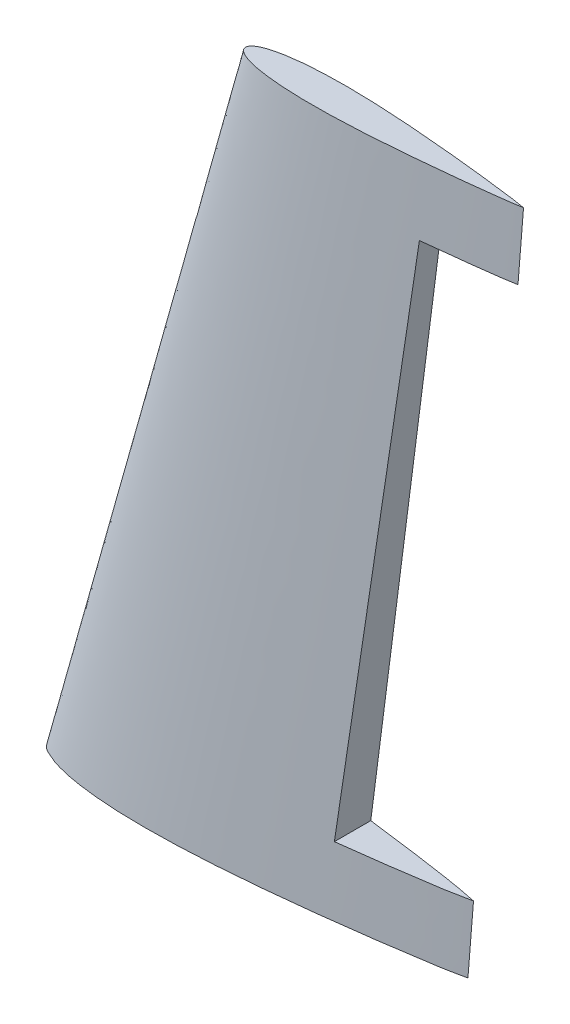
ISO-10303-21;
HEADER;
FILE_DESCRIPTION(('STEP AP214'),'2;1');
FILE_NAME('part.step','',(''),(''),'','','');
FILE_SCHEMA(('AUTOMOTIVE_DESIGN { 1 0 10303 214 1 1 1 1 }'));
ENDSEC;
DATA;
#1=APPLICATION_CONTEXT('core data for automotive mechanical design processes');
#2=APPLICATION_PROTOCOL_DEFINITION('international standard','automotive_design',2000,#1);
#3=PRODUCT_CONTEXT('',#1,'mechanical');
#4=PRODUCT('Part','Part','',(#3));
#5=PRODUCT_RELATED_PRODUCT_CATEGORY('part','',(#4));
#6=PRODUCT_DEFINITION_FORMATION('','',#4);
#7=PRODUCT_DEFINITION_CONTEXT('part definition',#1,'design');
#8=PRODUCT_DEFINITION('design','',#6,#7);
#9=PRODUCT_DEFINITION_SHAPE('','',#8);
#10=(LENGTH_UNIT() NAMED_UNIT(*) SI_UNIT(.MILLI.,.METRE.));
#11=(NAMED_UNIT(*) PLANE_ANGLE_UNIT() SI_UNIT($,.RADIAN.));
#12=(NAMED_UNIT(*) SI_UNIT($,.STERADIAN.) SOLID_ANGLE_UNIT());
#13=UNCERTAINTY_MEASURE_WITH_UNIT(LENGTH_MEASURE(1.E-05),#10,'distance_accuracy_value','');
#14=(GEOMETRIC_REPRESENTATION_CONTEXT(3) GLOBAL_UNCERTAINTY_ASSIGNED_CONTEXT((#13)) GLOBAL_UNIT_ASSIGNED_CONTEXT((#10,
#11,#12)) REPRESENTATION_CONTEXT('',''));
#15=CARTESIAN_POINT('',(0.,0.,0.));
#16=DIRECTION('',(0.,0.,1.));
#17=DIRECTION('',(1.,0.,0.));
#18=AXIS2_PLACEMENT_3D('',#15,#16,#17);
#19=CARTESIAN_POINT('',(0.,0.,0.));
#20=CARTESIAN_POINT('',(70.,250.,0.));
#21=CARTESIAN_POINT('',(0.195655478270852,0.,0.768978353918807));
#22=CARTESIAN_POINT('',(69.9986959845257,250.,0.559557329975513));
#23=CARTESIAN_POINT('',(0.660572033620584,0.,1.90007401564167));
#24=CARTESIAN_POINT('',(70.4422059324332,250.,1.26093304533634));
#25=CARTESIAN_POINT('',(1.52946508615385,0.,3.1403496450901));
#26=CARTESIAN_POINT('',(71.2121542995077,250.,1.88563978889603));
#27=CARTESIAN_POINT('',(2.08744009329708,0.,3.73764641932674));
#28=CARTESIAN_POINT('',(71.6667755137423,250.,2.17536174032659));
#29=CARTESIAN_POINT('',(3.08187299954048,0.,4.62172729711457));
#30=CARTESIAN_POINT('',(72.4329623126014,250.,2.61245656864863));
#31=CARTESIAN_POINT('',(4.19325189814782,0.,5.21603391430506));
#32=CARTESIAN_POINT('',(73.1948590143615,250.,2.94033718487233));
#33=CARTESIAN_POINT('',(5.59158015090889,0.,5.85259541205401));
#34=CARTESIAN_POINT('',(74.1415097621237,250.,3.28449303859547));
#35=CARTESIAN_POINT('',(6.68097742812297,0.,6.3337610745264));
#36=CARTESIAN_POINT('',(74.8869826600464,250.,3.53140799117662));
#37=CARTESIAN_POINT('',(8.12990500399271,0.,6.91831102915743));
#38=CARTESIAN_POINT('',(75.8834310114874,250.,3.819225587461));
#39=CARTESIAN_POINT('',(9.73930368303478,0.,7.45106762134593));
#40=CARTESIAN_POINT('',(76.9722727163433,250.,4.08980488765973));
#41=CARTESIAN_POINT('',(10.9062769503005,0.,7.78320423819411));
#42=CARTESIAN_POINT('',(77.7545849567519,250.,4.26170468307525));
#43=CARTESIAN_POINT('',(12.4576936991834,0.,8.20016367855782));
#44=CARTESIAN_POINT('',(78.7942261907797,250.,4.4758230209911));
#45=CARTESIAN_POINT('',(13.6696072170429,0.,8.49285134046993));
#46=CARTESIAN_POINT('',(79.6057609647194,250.,4.6240211178324));
#47=CARTESIAN_POINT('',(15.9014214187112,0.,8.97499562861494));
#48=CARTESIAN_POINT('',(81.096511241294,250.,4.86794863902424));
#49=CARTESIAN_POINT('',(17.8006239355461,0.,9.33262730154482));
#50=CARTESIAN_POINT('',(82.3614405724931,250.,5.04879621995214));
#51=CARTESIAN_POINT('',(19.9738741598646,0.,9.67697903054977));
#52=CARTESIAN_POINT('',(83.8063814045382,250.,5.22258488040277));
#53=CARTESIAN_POINT('',(22.238950637709,0.,9.99957996172536));
#54=CARTESIAN_POINT('',(85.3108301729104,250.,5.38564414124795));
#55=CARTESIAN_POINT('',(24.0482170869822,0.,10.2162956776922));
#56=CARTESIAN_POINT('',(86.5109885313154,250.,5.49490150487442));
#57=CARTESIAN_POINT('',(26.560353060244,0.,10.4772827523105));
#58=CARTESIAN_POINT('',(88.1762870085194,250.,5.62611207392554));
#59=CARTESIAN_POINT('',(29.1860847168737,0.,10.711773786491));
#60=CARTESIAN_POINT('',(89.9158243877766,250.,5.74368503992877));
#61=CARTESIAN_POINT('',(32.8966208658665,0.,10.956328312211));
#62=CARTESIAN_POINT('',(92.3724388839714,250.,5.86408546122133));
#63=CARTESIAN_POINT('',(37.7506876990212,0.,11.1715663050003));
#64=CARTESIAN_POINT('',(95.5841901256043,250.,5.96905050552955));
#65=CARTESIAN_POINT('',(41.4256776455018,0.,11.2397813072375));
#66=CARTESIAN_POINT('',(98.0150607926343,250.,5.99967397330177));
#67=CARTESIAN_POINT('',(47.7391016485707,0.,11.2685271452159));
#68=CARTESIAN_POINT('',(102.190912434374,250.,6.00624507222266));
#69=CARTESIAN_POINT('',(51.9472947406066,0.,11.1911552796935));
#70=CARTESIAN_POINT('',(104.974151836875,250.,5.96002880896557));
#71=CARTESIAN_POINT('',(58.545986993472,0.,10.9558171505861));
#72=CARTESIAN_POINT('',(109.339375626508,250.,5.82913889742743));
#73=CARTESIAN_POINT('',(62.6309350556134,0.,10.7636434588563));
#74=CARTESIAN_POINT('',(112.042120239292,250.,5.72418241247027));
#75=CARTESIAN_POINT('',(69.6371477236821,0.,10.3386957280969));
#76=CARTESIAN_POINT('',(116.678981021888,250.,5.49400875315719));
#77=CARTESIAN_POINT('',(75.7325892229276,0.,9.88192490979644));
#78=CARTESIAN_POINT('',(120.714304376761,250.,5.2487480096044));
#79=CARTESIAN_POINT('',(85.3875019683624,0.,9.04220406718952));
#80=CARTESIAN_POINT('',(127.108494642406,250.,4.79730346754375));
#81=CARTESIAN_POINT('',(93.2631752816847,0.,8.2339333571308));
#82=CARTESIAN_POINT('',(132.32694058254,250.,4.36495736487871));
#83=CARTESIAN_POINT('',(100.935206436467,0.,7.3569912462122));
#84=CARTESIAN_POINT('',(137.412743426146,250.,3.8962239895977));
#85=CARTESIAN_POINT('',(105.028527038898,0.,6.86961961426604));
#86=CARTESIAN_POINT('',(140.126734239389,250.,3.63533409708325));
#87=CARTESIAN_POINT('',(111.00814854933,0.,6.13128831658997));
#88=CARTESIAN_POINT('',(144.09199160909,250.,3.23889356195476));
#89=CARTESIAN_POINT('',(116.824459846816,0.,5.36694345391713));
#90=CARTESIAN_POINT('',(147.950402588865,250.,2.82967749691622));
#91=CARTESIAN_POINT('',(121.651751284019,0.,4.68691190438806));
#92=CARTESIAN_POINT('',(151.15473707171,250.,2.47089840367072));
#93=CARTESIAN_POINT('',(125.183426613864,0.,4.17923310063453));
#94=CARTESIAN_POINT('',(153.499433724026,250.,2.20333752457805));
#95=CARTESIAN_POINT('',(127.928645834009,0.,3.7745444218425));
#96=CARTESIAN_POINT('',(155.322326762007,250.,1.98988689627928));
#97=CARTESIAN_POINT('',(131.447905638187,0.,3.24877076078578));
#98=CARTESIAN_POINT('',(157.659061458258,250.,1.70919303152666));
#99=CARTESIAN_POINT('',(133.260010722783,0.,2.97619084244031));
#100=CARTESIAN_POINT('',(158.862117293063,250.,1.56187611570257));
#101=CARTESIAN_POINT('',(135.560122012606,0.,2.63126488818203));
#102=CARTESIAN_POINT('',(160.388585022168,250.,1.37122079182081));
#103=CARTESIAN_POINT('',(137.460372810935,0.,2.34549252058881));
#104=CARTESIAN_POINT('',(161.649404654787,250.,1.21094186091351));
#105=CARTESIAN_POINT('',(139.569414816383,0.,2.01420764055358));
#106=CARTESIAN_POINT('',(163.049958556808,250.,1.03133532697253));
#107=CARTESIAN_POINT('',(141.642227189136,0.,1.66900661728628));
#108=CARTESIAN_POINT('',(164.428661951161,250.,0.854999673307673));
#109=CARTESIAN_POINT('',(145.017744861793,0.,1.05825280822502));
#110=CARTESIAN_POINT('',(166.678308373102,250.,0.561150371082092));
#111=CARTESIAN_POINT('',(147.972088500631,0.,0.428792180378057));
#112=CARTESIAN_POINT('',(168.652734649163,250.,0.259454475548223));
#113=CARTESIAN_POINT('',(150.,0.,0.));
#114=CARTESIAN_POINT('',(170.,250.,0.));
#115=B_SPLINE_SURFACE_WITH_KNOTS('',3,1,((#19,#20),(#21,#22),(#23,#24),(#25,#26),(#27,#28),(#29,
#30),(#31,#32),(#33,#34),(#35,#36),(#37,#38),(#39,#40),(#41,#42),(#43,#44),(#45,#46),(#47,#48),
(#49,#50),(#51,#52),(#53,#54),(#55,#56),(#57,#58),(#59,#60),(#61,#62),(#63,#64),(#65,#66),(#67,
#68),(#69,#70),(#71,#72),(#73,#74),(#75,#76),(#77,#78),(#79,#80),(#81,#82),(#83,#84),(#85,#86),
(#87,#88),(#89,#90),(#91,#92),(#93,#94),(#95,#96),(#97,#98),(#99,#100),(#101,#102),(#103,#104),
(#105,#106),(#107,#108),(#109,#110),(#111,#112),(#113,#114)),.UNSPECIFIED.,.F.,.F.,.F.,(4,1,1,1,
1,1,1,1,1,1,1,1,1,1,1,1,1,1,1,1,1,1,1,1,1,1,1,1,1,1,1,1,1,1,1,1,1,1,1,1,1,1,1,1,1,4),(2,2),(0.,
0.0156194720662421,0.0232753433303846,0.0291075419286404,0.0314587429481263,0.0492202555491914,
0.0533777786080139,0.061074796097928,0.072332266250758,0.0838833871498787,0.0940592622044786,
0.0958977986291186,0.11511405027081,0.118322991217731,0.140338064377994,0.152703718571922,
0.16113752489231,0.184858630441784,0.188156909079162,0.210283618990624,0.236152465437243,
0.26051404840834,0.304825518045286,0.307670319858064,0.383371055636416,0.38671265586774,
0.436156501706642,0.462946641558057,0.523300177064844,0.555096393590515,0.651536044513161,
0.67735316070774,0.70535980619585,0.731752349684996,0.794596405394819,0.819513726604711,
0.826616135313176,0.864027539878722,0.873511499820556,0.895859043763776,0.899686854178034,
0.918771100295154,0.933252916444237,0.941229566110318,0.959662243740333,1.),(0.,1.),.UNSPECIFIED.);
#116=DIRECTION('',(0.07974522228289,0.996815278536125,0.));
#117=VECTOR('',#116,1.);
#118=CARTESIAN_POINT('',(160.,125.,0.));
#119=LINE('',#118,#117);
#120=CARTESIAN_POINT('',(150.,0.,0.));
#121=VERTEX_POINT('',#120);
#122=CARTESIAN_POINT('',(152.,25.,0.));
#123=VERTEX_POINT('',#122);
#124=EDGE_CURVE('E132',#121,#123,#119,.T.);
#125=CARTESIAN_POINT('',(152.,25.,0.));
#126=CARTESIAN_POINT('',(151.401466096659,25.,0.12577945562425));
#127=CARTESIAN_POINT('',(150.802875475921,25.,0.251344221995793));
#128=CARTESIAN_POINT('',(149.605094931907,25.,0.499857752519421));
#129=CARTESIAN_POINT('',(149.005904957979,25.,0.622806271793478));
#130=CARTESIAN_POINT('',(148.106561817352,25.,0.80357428195709));
#131=CARTESIAN_POINT('',(147.806773955936,25.,0.863204548641396));
#132=CARTESIAN_POINT('',(147.206908653375,25.,0.980990936937096));
#133=CARTESIAN_POINT('',(146.906831212456,25.,1.03914705969305));
#134=CARTESIAN_POINT('',(146.306349868556,25.,1.15368035969721));
#135=CARTESIAN_POINT('',(146.005945980211,25.,1.21005761354412));
#136=CARTESIAN_POINT('',(145.404783041826,25.,1.32088638432623));
#137=CARTESIAN_POINT('',(145.104023991628,25.,1.37533790039718));
#138=CARTESIAN_POINT('',(144.502269483059,25.,1.48235569392));
#139=CARTESIAN_POINT('',(144.201274130468,25.,1.53492256618896));
#140=CARTESIAN_POINT('',(143.598959261173,25.,1.63816291237761));
#141=CARTESIAN_POINT('',(143.297639744661,25.,1.68883638742533));
#142=CARTESIAN_POINT('',(142.393242639191,25.,1.8382912195825));
#143=CARTESIAN_POINT('',(141.789740963887,25.,1.9345044234058));
#144=CARTESIAN_POINT('',(140.884003215696,25.,2.07568711975079));
#145=CARTESIAN_POINT('',(140.582007757344,25.,2.1222254650044));
#146=CARTESIAN_POINT('',(139.977903803053,25.,2.21456384304779));
#147=CARTESIAN_POINT('',(139.675795307184,25.,2.26036387629823));
#148=CARTESIAN_POINT('',(139.071502297875,25.,2.35144027638195));
#149=CARTESIAN_POINT('',(138.769317785105,25.,2.39671664768351));
#150=CARTESIAN_POINT('',(138.164898302783,25.,2.48693137314008));
#151=CARTESIAN_POINT('',(137.862663333226,25.,2.53186972725631));
#152=CARTESIAN_POINT('',(137.258186089737,25.,2.621603566149));
#153=CARTESIAN_POINT('',(136.955943816743,25.,2.6663990572471));
#154=CARTESIAN_POINT('',(136.351465271619,25.,2.75603031708626));
#155=CARTESIAN_POINT('',(136.049228999489,25.,2.80086608582323));
#156=CARTESIAN_POINT('',(135.142516699823,25.,2.93535448408979));
#157=CARTESIAN_POINT('',(134.538037847072,25.,3.02498810801186));
#158=CARTESIAN_POINT('',(133.329061694945,25.,3.20382412682929));
#159=CARTESIAN_POINT('',(132.724564400193,25.,3.29302655294343));
#160=CARTESIAN_POINT('',(131.515475910239,25.,3.47079153634192));
#161=CARTESIAN_POINT('',(130.910884715072,25.,3.55935409385954));
#162=CARTESIAN_POINT('',(129.701676398702,25.,3.73565715964735));
#163=CARTESIAN_POINT('',(129.097059295476,25.,3.82339779108049));
#164=CARTESIAN_POINT('',(127.88768249238,25.,3.99789080830132));
#165=CARTESIAN_POINT('',(127.282922792484,25.,4.08464319391855));
#166=CARTESIAN_POINT('',(125.46831407215,25.,4.34314084050919));
#167=CARTESIAN_POINT('',(124.258211495495,25.,4.51311545248135));
#168=CARTESIAN_POINT('',(122.442405039625,25.,4.76368316354632));
#169=CARTESIAN_POINT('',(121.837004345829,25.,4.8464764410217));
#170=CARTESIAN_POINT('',(120.625995099168,25.,5.01052894731695));
#171=CARTESIAN_POINT('',(120.020386546279,25.,5.09178817596005));
#172=CARTESIAN_POINT('',(118.203148989881,25.,5.33337632241521));
#173=CARTESIAN_POINT('',(116.991226153294,25.,5.49149942125487));
#174=CARTESIAN_POINT('',(114.566531867729,25.,5.80226410612558));
#175=CARTESIAN_POINT('',(113.353760334567,25.,5.95490503404879));
#176=CARTESIAN_POINT('',(110.927419406694,25.,6.25509953813406));
#177=CARTESIAN_POINT('',(109.713849925658,25.,6.40265241688473));
#178=CARTESIAN_POINT('',(108.5,25.,6.54784754542871));
#179=B_SPLINE_CURVE_WITH_KNOTS('',3,(#125,#126,#127,#128,#129,#130,#131,#132,#133,#134,#135,
#136,#137,#138,#139,#140,#141,#142,#143,#144,#145,#146,#147,#148,#149,#150,#151,#152,#153,#154,
#155,#156,#157,#158,#159,#160,#161,#162,#163,#164,#165,#166,#167,#168,#169,#170,#171,#172,#173,
#174,#175,#176,#177,#178),.UNSPECIFIED.,.F.,.F.,(4,2,2,2,2,2,2,2,2,2,2,2,2,2,2,2,2,2,2,2,2,2,2,
2,2,2,4),(0.,1.83484077461232,3.66985253965584,4.58683163883149,5.50381002602246,
6.42074887377736,7.33768813304953,8.25433540054875,9.17098212193016,11.0043196447908,
11.9210005569045,12.8376808970409,13.7543534095693,14.6710260272402,15.5876575033591,
16.5042888863669,18.3375536481823,20.170683631509,22.0038129465787,23.8366630320923,
25.6695134337581,29.3354448628915,31.1685504580636,33.0016562644594,36.6682254184897,
40.3352332649767,44.0027417608705),.UNSPECIFIED.);
#180=CARTESIAN_POINT('',(108.5,25.,6.54784754542871));
#181=VERTEX_POINT('',#180);
#182=EDGE_CURVE('E205',#123,#181,#179,.T.);
#183=CARTESIAN_POINT('',(108.5,25.,6.54784754542871));
#184=CARTESIAN_POINT('',(110.833333573895,41.6666683849627,6.33305481620149));
#185=CARTESIAN_POINT('',(113.166667106372,58.3333364740852,6.11823867808425));
#186=CARTESIAN_POINT('',(117.833334062421,91.6666718744377,5.68854490436401));
#187=CARTESIAN_POINT('',(120.166667485993,108.333339185668,5.473667268761));
#188=CARTESIAN_POINT('',(124.833334198452,141.666672846085,5.04383582033692));
#189=CARTESIAN_POINT('',(127.166667487338,158.333339195271,4.82888200751584));
#190=CARTESIAN_POINT('',(131.833333887544,191.666670625313,4.39887410889263));
#191=CARTESIAN_POINT('',(134.166666998863,208.333335706167,4.18382002309049));
#192=CARTESIAN_POINT('',(136.5,225.,3.96870375291261));
#193=B_SPLINE_CURVE_WITH_KNOTS('',3,(#183,#184,#185,#186,#187,#188,#189,#190,#191,#192),
.UNSPECIFIED.,.F.,.F.,(4,2,2,2,4),(0.,50.4917394119644,100.983478822807,151.475218237651,
201.966957653616),.UNSPECIFIED.);
#194=CARTESIAN_POINT('',(136.5,225.,3.96870375291261));
#195=VERTEX_POINT('',#194);
#196=EDGE_CURVE('E125',#181,#195,#193,.T.);
#197=CARTESIAN_POINT('',(136.5,225.,3.96870375291261));
#198=CARTESIAN_POINT('',(137.377695952224,225.,3.87986091876744));
#199=CARTESIAN_POINT('',(138.25523715755,225.,3.78948923577797));
#200=CARTESIAN_POINT('',(140.009920399032,225.,3.60569240039433));
#201=CARTESIAN_POINT('',(140.887062463867,225.,3.51226752179798));
#202=CARTESIAN_POINT('',(142.64094696346,225.,3.32235997294791));
#203=CARTESIAN_POINT('',(143.517689423863,225.,3.2258775395702));
#204=CARTESIAN_POINT('',(145.270769473028,225.,3.02980759405548));
#205=CARTESIAN_POINT('',(146.147107084388,225.,2.93022028401529));
#206=CARTESIAN_POINT('',(147.899378385918,225.,2.72795216478344));
#207=CARTESIAN_POINT('',(148.775312094906,225.,2.62527151855961));
#208=CARTESIAN_POINT('',(150.526792722341,225.,2.41696984914526));
#209=CARTESIAN_POINT('',(151.402339655389,225.,2.31134894869247));
#210=CARTESIAN_POINT('',(152.715451037879,225.,2.15087248748527));
#211=CARTESIAN_POINT('',(153.153140451367,225.,2.09703691756777));
#212=CARTESIAN_POINT('',(154.028438322902,225.,1.98871177744516));
#213=CARTESIAN_POINT('',(154.466046780965,225.,1.93422220736869));
#214=CARTESIAN_POINT('',(155.341179054448,225.,1.82450763081202));
#215=CARTESIAN_POINT('',(155.778702868307,225.,1.76928261186724));
#216=CARTESIAN_POINT('',(156.653650935464,225.,1.65804958365526));
#217=CARTESIAN_POINT('',(157.091075188784,225.,1.60204157456365));
#218=CARTESIAN_POINT('',(157.965819355844,225.,1.4891289622505));
#219=CARTESIAN_POINT('',(158.403139266612,225.,1.43222433601277));
#220=CARTESIAN_POINT('',(159.277690176855,225.,1.31774003824));
#221=CARTESIAN_POINT('',(159.714921176416,225.,1.26016036735882));
#222=CARTESIAN_POINT('',(160.370719955416,225.,1.17337304319059));
#223=CARTESIAN_POINT('',(160.589315343359,225.,1.1443737979291));
#224=CARTESIAN_POINT('',(161.026491522415,225.,1.08626503706974));
#225=CARTESIAN_POINT('',(161.245072313524,225.,1.05715552144238));
#226=CARTESIAN_POINT('',(161.6821940353,225.,0.998619146831524));
#227=CARTESIAN_POINT('',(161.900734965504,225.,0.969192284361424));
#228=CARTESIAN_POINT('',(162.33774186504,225.,0.909788135510916));
#229=CARTESIAN_POINT('',(162.55620783439,225.,0.879810849266727));
#230=CARTESIAN_POINT('',(163.211496702824,225.,0.788737010199306));
#231=CARTESIAN_POINT('',(163.648163630418,225.,0.726504668538582));
#232=CARTESIAN_POINT('',(164.520802558458,225.,0.597421793175145));
#233=CARTESIAN_POINT('',(164.95677458324,225.,0.530571425012477));
#234=CARTESIAN_POINT('',(165.828047841313,225.,0.390847624298362));
#235=CARTESIAN_POINT('',(166.263348467967,225.,0.317970370383577));
#236=CARTESIAN_POINT('',(167.132707712607,225.,0.164850529812257));
#237=CARTESIAN_POINT('',(167.566766158683,225.,0.0846069701410448));
#238=CARTESIAN_POINT('',(168.,225.,0.));
#239=B_SPLINE_CURVE_WITH_KNOTS('',3,(#197,#198,#199,#200,#201,#202,#203,#204,#205,#206,#207,
#208,#209,#210,#211,#212,#213,#214,#215,#216,#217,#218,#219,#220,#221,#222,#223,#224,#225,#226,
#227,#228,#229,#230,#231,#232,#233,#234,#235,#236,#237,#238),.UNSPECIFIED.,.F.,.F.,(4,2,2,2,2,2,
2,2,2,2,2,2,2,2,2,2,2,2,2,2,4),(0.,2.64654152484641,5.29284636665004,7.93894669173812,
10.5848751399155,13.23066443422,15.8763434480449,17.199306648192,18.5222695881268,
19.8452549785784,21.1682400723323,22.4912591826522,23.8142770115598,24.4758086159216,
25.1373403973476,25.7988794542859,26.460418347507,27.7836381474391,29.1068105391733,
30.430828420595,31.7550214437632),.UNSPECIFIED.);
#240=CARTESIAN_POINT('',(168.,225.,0.));
#241=VERTEX_POINT('',#240);
#242=EDGE_CURVE('E117',#195,#241,#239,.T.);
#243=CARTESIAN_POINT('',(170.,250.,0.));
#244=VERTEX_POINT('',#243);
#245=EDGE_CURVE('E91',#241,#244,#119,.T.);
#246=CARTESIAN_POINT('',(70.,250.,0.));
#247=CARTESIAN_POINT('',(69.9986959845257,250.,0.559557329975513));
#248=CARTESIAN_POINT('',(70.4422059324332,250.,1.26093304533634));
#249=CARTESIAN_POINT('',(71.2121542995077,250.,1.88563978889603));
#250=CARTESIAN_POINT('',(72.1765692085123,250.,2.5002441247187));
#251=CARTESIAN_POINT('',(73.3608592933965,250.,3.01855792734228));
#252=CARTESIAN_POINT('',(75.1227205315784,250.,3.61875069370607));
#253=CARTESIAN_POINT('',(76.6590687383961,250.,4.02363435400375));
#254=CARTESIAN_POINT('',(78.4538796406858,250.,4.41367077242441));
#255=CARTESIAN_POINT('',(80.7556730736961,250.,4.83401185582356));
#256=CARTESIAN_POINT('',(83.8644573815094,250.,5.25286849011772));
#257=CARTESIAN_POINT('',(87.9614350359515,250.,5.63382877374754));
#258=CARTESIAN_POINT('',(93.1247858390843,250.,5.92406082995801));
#259=CARTESIAN_POINT('',(99.7600745373847,250.,6.04543960753283));
#260=CARTESIAN_POINT('',(107.468637421375,250.,5.92114767489454));
#261=CARTESIAN_POINT('',(115.967916908944,250.,5.556531892471));
#262=CARTESIAN_POINT('',(125.06405736576,250.,4.96668425616192));
#263=CARTESIAN_POINT('',(134.169678192368,250.,4.21228731080838));
#264=CARTESIAN_POINT('',(143.35607633263,250.,3.32749838658548));
#265=CARTESIAN_POINT('',(150.536726311052,250.,2.55025407184005));
#266=CARTESIAN_POINT('',(156.205971927044,250.,1.8864169659321));
#267=CARTESIAN_POINT('',(159.803934973752,250.,1.44813753014802));
#268=CARTESIAN_POINT('',(164.387726212406,250.,0.858989173143308));
#269=CARTESIAN_POINT('',(167.770673401732,250.,0.429320595990857));
#270=CARTESIAN_POINT('',(170.,250.,0.));
#271=B_SPLINE_CURVE_WITH_KNOTS('',3,(#246,#247,#248,#249,#250,#251,#252,#253,#254,#255,#256,
#257,#258,#259,#260,#261,#262,#263,#264,#265,#266,#267,#268,#269,#270),.UNSPECIFIED.,.F.,.F.,(4,
1,1,1,1,1,1,1,1,1,1,1,1,1,1,1,1,1,1,1,1,1,4),(0.,0.01553395472415,0.0231479097340726,
0.0289481767714817,0.0489507723417046,0.060740408724977,0.08342412167123,0.0953727536841635,
0.114483795446904,0.151867658551169,0.187126741177681,0.234859519613783,0.303156584038135,
0.381272081127289,0.460411986984034,0.552057214802432,0.647968854113404,0.727745971252401,
0.822090373205299,0.859296948576311,0.894761026457467,0.928143312958565,0.994524953101524),.UNSPECIFIED.);
#272=CARTESIAN_POINT('',(70.,250.,0.));
#273=VERTEX_POINT('',#272);
#274=EDGE_CURVE('E135',#273,#244,#271,.T.);
#275=DIRECTION('',(-0.269629925519971,-0.962964019714182,0.));
#276=VECTOR('',#275,1.);
#277=CARTESIAN_POINT('',(35.,125.,0.));
#278=LINE('',#277,#276);
#279=CARTESIAN_POINT('',(0.,0.,0.));
#280=VERTEX_POINT('',#279);
#281=EDGE_CURVE('E133',#273,#280,#278,.T.);
#282=CARTESIAN_POINT('',(0.,0.,0.));
#283=CARTESIAN_POINT('',(0.394064240533343,0.,1.54877785023788));
#284=CARTESIAN_POINT('',(1.86343204533623,0.,4.10832932730232));
#285=CARTESIAN_POINT('',(5.28724909036249,0.,5.73617099980628));
#286=CARTESIAN_POINT('',(8.233222924377,0.,6.99931868497217));
#287=CARTESIAN_POINT('',(11.4396082336292,0.,7.96107398576362));
#288=CARTESIAN_POINT('',(14.8376369190267,0.,8.77467837603829));
#289=CARTESIAN_POINT('',(18.2267385280419,0.,9.41286733557134));
#290=CARTESIAN_POINT('',(21.6078998652314,0.,9.92399207912031));
#291=CARTESIAN_POINT('',(25.1773993496458,0.,10.3515502404508));
#292=CARTESIAN_POINT('',(30.2638636077661,0.,10.8139908288503));
#293=CARTESIAN_POINT('',(36.5674158128002,0.,11.1547863026209));
#294=CARTESIAN_POINT('',(45.6336442745833,0.,11.3133994355685));
#295=CARTESIAN_POINT('',(54.6599512158032,0.,11.1386331448724));
#296=CARTESIAN_POINT('',(65.7291347742381,0.,10.617890693194));
#297=CARTESIAN_POINT('',(80.6283538857991,0.,9.55346562254067));
#298=CARTESIAN_POINT('',(94.3915178799787,0.,8.13611618668952));
#299=CARTESIAN_POINT('',(108.235367187247,0.,6.48779686733447));
#300=CARTESIAN_POINT('',(115.481434177457,0.,5.5561385416536));
#301=CARTESIAN_POINT('',(124.038094924345,0.,4.35074223563081));
#302=CARTESIAN_POINT('',(129.185840061393,0.,3.58903449905146));
#303=CARTESIAN_POINT('',(134.229817913528,0.,2.83031080098395));
#304=CARTESIAN_POINT('',(137.67143784106,0.,2.31536058736914));
#305=CARTESIAN_POINT('',(140.909856218911,0.,1.8015191392422));
#306=CARTESIAN_POINT('',(145.017744861793,0.,1.05825280822502));
#307=CARTESIAN_POINT('',(147.972088500631,0.,0.428792180378057));
#308=CARTESIAN_POINT('',(150.,0.,0.));
#309=B_SPLINE_CURVE_WITH_KNOTS('',3,(#282,#283,#284,#285,#286,#287,#288,#289,#290,#291,#292,
#293,#294,#295,#296,#297,#298,#299,#300,#301,#302,#303,#304,#305,#306,#307,#308),.UNSPECIFIED.,
.F.,.F.,(4,1,1,1,1,1,1,1,1,1,1,1,1,1,1,1,1,1,1,1,1,1,1,1,4),(0.,0.0314587429481263,
0.0533777786080139,0.072332266250758,0.0940592622044786,0.118322991217731,0.140338064377994,
0.16113752489231,0.184858630441784,0.210283618990624,0.26051404840834,0.307670319858064,
0.38671265586774,0.436156501706642,0.523300177064844,0.67735316070774,0.70535980619585,
0.794596405394819,0.819513726604711,0.873511499820556,0.895859043763776,0.918771100295154,
0.941229566110318,0.959662243740333,1.),.UNSPECIFIED.);
#310=EDGE_CURVE('E158',#280,#121,#309,.T.);
#311=ORIENTED_EDGE('',*,*,#124,.T.);
#312=ORIENTED_EDGE('',*,*,#182,.T.);
#313=ORIENTED_EDGE('',*,*,#196,.T.);
#314=ORIENTED_EDGE('',*,*,#242,.T.);
#315=ORIENTED_EDGE('',*,*,#245,.T.);
#316=ORIENTED_EDGE('',*,*,#274,.F.);
#317=ORIENTED_EDGE('',*,*,#281,.T.);
#318=ORIENTED_EDGE('',*,*,#310,.T.);
#319=EDGE_LOOP('',(#311,#312,#313,#314,#315,#316,#317,#318));
#320=FACE_BOUND('',#319,.T.);
#321=ADVANCED_FACE('F62',(#320),#115,.T.);
#322=CARTESIAN_POINT('',(150.,0.,0.));
#323=CARTESIAN_POINT('',(170.,250.,0.));
#324=CARTESIAN_POINT('',(147.203728736896,0.,-0.596703086503725));
#325=CARTESIAN_POINT('',(168.141300436859,250.,-0.357945760326691));
#326=CARTESIAN_POINT('',(143.844542392479,0.,-1.29910346176235));
#327=CARTESIAN_POINT('',(165.893928859177,250.,-0.667686172563832));
#328=CARTESIAN_POINT('',(139.646817536484,0.,-2.00299402022177));
#329=CARTESIAN_POINT('',(163.101269806163,250.,-1.02473432634902));
#330=CARTESIAN_POINT('',(137.378976492,0.,-2.35719623647766));
#331=CARTESIAN_POINT('',(161.595535250208,250.,-1.21786562108361));
#332=CARTESIAN_POINT('',(134.845344194033,0.,-2.74059609804921));
#333=CARTESIAN_POINT('',(159.914206394984,250.,-1.43134010667307));
#334=CARTESIAN_POINT('',(132.144215255794,0.,-3.14366262231544));
#335=CARTESIAN_POINT('',(158.121488937878,250.,-1.65308168598492));
#336=CARTESIAN_POINT('',(129.692886778842,0.,-3.51072899413155));
#337=CARTESIAN_POINT('',(156.493874863831,250.,-1.84963275853149));
#338=CARTESIAN_POINT('',(126.975661850402,0.,-3.91474951276233));
#339=CARTESIAN_POINT('',(154.689566267685,250.,-2.06380021990477));
#340=CARTESIAN_POINT('',(125.07344856666,0.,-4.19344634310769));
#341=CARTESIAN_POINT('',(153.42651749819,250.,-2.21090594959557));
#342=CARTESIAN_POINT('',(122.712139851787,0.,-4.53500965246532));
#343=CARTESIAN_POINT('',(151.858755186052,250.,-2.39090188609898));
#344=CARTESIAN_POINT('',(117.717426361797,0.,-5.24761504038376));
#345=CARTESIAN_POINT('',(148.542876612811,250.,-2.76607135121046));
#346=CARTESIAN_POINT('',(111.547253695246,0.,-6.06439532936574));
#347=CARTESIAN_POINT('',(144.449529585196,250.,-3.20311463056925));
#348=CARTESIAN_POINT('',(105.153517956725,0.,-6.85419964317565));
#349=CARTESIAN_POINT('',(140.209632819831,250.,-3.6270544819082));
#350=CARTESIAN_POINT('',(101.060310055639,0.,-7.34237511336335));
#351=CARTESIAN_POINT('',(137.495687662368,250.,-3.88841172885298));
#352=CARTESIAN_POINT('',(93.381164448233,0.,-8.22198456519109));
#353=CARTESIAN_POINT('',(132.405126127822,250.,-4.3584797245741));
#354=CARTESIAN_POINT('',(85.0065386548647,0.,-9.08178671234308));
#355=CARTESIAN_POINT('',(126.85608475217,250.,-4.81821552327612));
#356=CARTESIAN_POINT('',(76.3070571671548,0.,-9.83010912491948));
#357=CARTESIAN_POINT('',(121.094765690402,250.,-5.22088183216181));
#358=CARTESIAN_POINT('',(71.585227812655,0.,-10.1899128029993));
#359=CARTESIAN_POINT('',(117.968612266297,250.,-5.41427937671108));
#360=CARTESIAN_POINT('',(65.9694622987038,0.,-10.5725641939584));
#361=CARTESIAN_POINT('',(114.251408918626,250.,-5.62039650989662));
#362=CARTESIAN_POINT('',(60.9280804854935,0.,-10.8538526717753));
#363=CARTESIAN_POINT('',(110.915322788481,250.,-5.7732862139699));
#364=CARTESIAN_POINT('',(53.7139334312018,0.,-11.1420011573478));
#365=CARTESIAN_POINT('',(106.142765257583,250.,-5.93223574263261));
#366=CARTESIAN_POINT('',(48.4991525439816,0.,-11.2542541706935));
#367=CARTESIAN_POINT('',(102.693471715921,250.,-5.99814186735058));
#368=CARTESIAN_POINT('',(43.6660105940415,0.,-11.2541507292901));
#369=CARTESIAN_POINT('',(99.4968186685067,250.,-6.00416130647089));
#370=CARTESIAN_POINT('',(39.2310539432817,0.,-11.2098036827104));
#371=CARTESIAN_POINT('',(96.5633912178537,250.,-5.98696294868556));
#372=CARTESIAN_POINT('',(35.3443798402432,0.,-11.0842212734471));
#373=CARTESIAN_POINT('',(93.9923251259385,250.,-5.92699236879487));
#374=CARTESIAN_POINT('',(30.3051715556657,0.,-10.7932455742697));
#375=CARTESIAN_POINT('',(90.6568565076703,250.,-5.78400416344846));
#376=CARTESIAN_POINT('',(27.8454526230814,0.,-10.6028294457268));
#377=CARTESIAN_POINT('',(89.0280847897593,250.,-5.68909228005015));
#378=CARTESIAN_POINT('',(24.3678121330773,0.,-10.2537975653091));
#379=CARTESIAN_POINT('',(86.7230713523971,250.,-5.51382281057447));
#380=CARTESIAN_POINT('',(22.4077933297717,0.,-10.023361412358));
#381=CARTESIAN_POINT('',(85.4229768196155,250.,-5.39778849146758));
#382=CARTESIAN_POINT('',(19.5864170571401,0.,-9.62220410848912));
#383=CARTESIAN_POINT('',(83.5494559065639,250.,-5.19474926704572));
#384=CARTESIAN_POINT('',(17.250980841904,0.,-9.23855965249417));
#385=CARTESIAN_POINT('',(81.9962606792744,250.,-5.00116026420013));
#386=CARTESIAN_POINT('',(15.0423680420077,0.,-8.79513114326615));
#387=CARTESIAN_POINT('',(80.5226715002189,250.,-4.7779103509668));
#388=CARTESIAN_POINT('',(13.1955600239592,0.,-8.37962918025219));
#389=CARTESIAN_POINT('',(79.2891829538309,250.,-4.56620935151217));
#390=CARTESIAN_POINT('',(11.7226232514126,0.,-8.0189709132298));
#391=CARTESIAN_POINT('',(78.3051996396538,250.,-4.37971813530801));
#392=CARTESIAN_POINT('',(10.4887427738483,0.,-7.66731889966114));
#393=CARTESIAN_POINT('',(77.4753931528398,250.,-4.20103256931581));
#394=CARTESIAN_POINT('',(8.78449404351382,0.,-7.13409791776671));
#395=CARTESIAN_POINT('',(76.3218767849775,250.,-3.93477200384775));
#396=CARTESIAN_POINT('',(7.31586995213694,0.,-6.58997838004316));
#397=CARTESIAN_POINT('',(75.3154768180722,250.,-3.66954898961228));
#398=CARTESIAN_POINT('',(5.66535098363631,0.,-5.89162381906071));
#399=CARTESIAN_POINT('',(74.1961523502563,250.,-3.30310749325793));
#400=CARTESIAN_POINT('',(4.24922045566011,0.,-5.2641360661624));
#401=CARTESIAN_POINT('',(73.2421896388264,250.,-2.96113701082741));
#402=CARTESIAN_POINT('',(3.07177828200063,0.,-4.61366371132348));
#403=CARTESIAN_POINT('',(72.4270900342667,250.,-2.60988652018706));
#404=CARTESIAN_POINT('',(2.0757277646262,0.,-3.7303367121853));
#405=CARTESIAN_POINT('',(71.6613959313592,250.,-2.17193342889503));
#406=CARTESIAN_POINT('',(1.51976881197806,0.,-3.14448287345632));
#407=CARTESIAN_POINT('',(71.2121542995192,250.,-1.88563978890509));
#408=CARTESIAN_POINT('',(0.641088596380313,0.,-1.9143929377355));
#409=CARTESIAN_POINT('',(70.4422059324422,250.,-1.26093304535086));
#410=CARTESIAN_POINT('',(0.178531775094028,0.,-0.783109986582253));
#411=CARTESIAN_POINT('',(69.998695984537,250.,-0.559557329985034));
#412=CARTESIAN_POINT('',(0.,0.,0.));
#413=CARTESIAN_POINT('',(70.,250.,0.));
#414=B_SPLINE_SURFACE_WITH_KNOTS('',3,1,((#322,#323),(#324,#325),(#326,#327),(#328,#329),(#330,
#331),(#332,#333),(#334,#335),(#336,#337),(#338,#339),(#340,#341),(#342,#343),(#344,#345),(#346,
#347),(#348,#349),(#350,#351),(#352,#353),(#354,#355),(#356,#357),(#358,#359),(#360,#361),(#362,
#363),(#364,#365),(#366,#367),(#368,#369),(#370,#371),(#372,#373),(#374,#375),(#376,#377),(#378,
#379),(#380,#381),(#382,#383),(#384,#385),(#386,#387),(#388,#389),(#390,#391),(#392,#393),(#394,
#395),(#396,#397),(#398,#399),(#400,#401),(#402,#403),(#404,#405),(#406,#407),(#408,#409),(#410,
#411),(#412,#413)),.UNSPECIFIED.,.F.,.F.,.F.,(4,1,1,1,1,1,1,1,1,1,1,1,1,1,1,1,1,1,1,1,1,1,1,1,1,
1,1,1,1,1,1,1,1,1,1,1,1,1,1,1,1,1,1,4),(2,2),(0.,0.0556503363584711,0.0667470835557493,
0.0828268685228939,0.100313145821953,0.116611583931299,0.135972460121266,0.14854669159315,
0.170068705708347,0.173383864686812,0.194974932765051,0.268247650314993,0.29449720894224,
0.320338735181534,0.34846395548683,0.444903606409477,0.484151178595618,0.51837851314884,
0.537053358441937,0.59368294189974,0.616628944363578,0.677543847825017,0.69517448195471,
0.710677272087267,0.763847534562754,0.770830850668482,0.808897905053961,0.811843090920835,
0.838842075755816,0.847296281428076,0.867285395316784,0.884885949729188,0.891142238510914,
0.90410220137088,0.914346813798334,0.91611661285012,0.938925203902071,0.94492339637412,
0.950779744450808,0.968728684871204,0.970892458071359,0.976724656669615,0.984380527933758,1.),
(0.,1.),.UNSPECIFIED.);
#415=CARTESIAN_POINT('',(136.5,225.,-3.96870149239353));
#416=CARTESIAN_POINT('',(134.166666999392,208.333335709941,-4.18381622260481));
#417=CARTESIAN_POINT('',(131.833333888498,191.666670632131,-4.39886871038074));
#418=CARTESIAN_POINT('',(127.166667488978,158.333339206983,-4.82887331755868));
#419=CARTESIAN_POINT('',(124.83333420035,141.666672859645,-5.04382543696069));
#420=CARTESIAN_POINT('',(120.166667487852,108.333339198943,-5.47365342391937));
#421=CARTESIAN_POINT('',(117.833334063981,91.6666718855803,-5.68852929147604));
#422=CARTESIAN_POINT('',(113.166667107227,58.333336480192,-6.11821946774092));
#423=CARTESIAN_POINT('',(110.833333574343,41.6666683881667,-6.33303377644914));
#424=CARTESIAN_POINT('',(108.5,25.,-6.5478246522379));
#425=B_SPLINE_CURVE_WITH_KNOTS('',3,(#415,#416,#417,#418,#419,#420,#421,#422,#423,#424),
.UNSPECIFIED.,.F.,.F.,(4,2,2,2,4),(0.,50.4917393454856,100.983478689848,151.475218039432,
201.966957390141),.UNSPECIFIED.);
#426=CARTESIAN_POINT('',(136.5,225.,-3.96870149239353));
#427=VERTEX_POINT('',#426);
#428=CARTESIAN_POINT('',(108.5,25.,-6.5478246522379));
#429=VERTEX_POINT('',#428);
#430=EDGE_CURVE('E76',#427,#429,#425,.T.);
#431=CARTESIAN_POINT('',(108.5,25.,-6.5478246522379));
#432=CARTESIAN_POINT('',(109.713846170093,25.,-6.40260743753134));
#433=CARTESIAN_POINT('',(110.927409537191,25.,-6.25501168153393));
#434=CARTESIAN_POINT('',(113.353738333819,25.,-5.95473139218497));
#435=CARTESIAN_POINT('',(114.566503849564,25.,-5.8020475551898));
#436=CARTESIAN_POINT('',(116.991190865885,25.,-5.49123856025285));
#437=CARTESIAN_POINT('',(118.20311244991,25.,-5.33311405382542));
#438=CARTESIAN_POINT('',(120.626067188232,25.,-5.01108420583345));
#439=CARTESIAN_POINT('',(121.837100418246,25.,-4.84717943489631));
#440=CARTESIAN_POINT('',(123.652962429466,25.,-4.59668062780731));
#441=CARTESIAN_POINT('',(124.25811254707,25.,-4.51241064986052));
#442=CARTESIAN_POINT('',(125.468221073377,25.,-4.3425043907147));
#443=CARTESIAN_POINT('',(126.073179481989,25.,-4.25686810887801));
#444=CARTESIAN_POINT('',(127.887739268609,25.,-3.99829874964018));
#445=CARTESIAN_POINT('',(129.097102720357,25.,-3.82369440438149));
#446=CARTESIAN_POINT('',(130.910837591359,25.,-3.55903162111814));
#447=CARTESIAN_POINT('',(131.51540991889,25.,-3.4703444977418));
#448=CARTESIAN_POINT('',(132.422214431026,25.,-3.33694570155271));
#449=CARTESIAN_POINT('',(132.724473694807,25.,-3.29241807104763));
#450=CARTESIAN_POINT('',(133.328981384586,25.,-3.20328911542749));
#451=CARTESIAN_POINT('',(133.631229810582,25.,-3.15868779030435));
#452=CARTESIAN_POINT('',(134.235747423371,25.,-3.06945661441968));
#453=CARTESIAN_POINT('',(134.538016609867,25.,-3.02482676164345));
#454=CARTESIAN_POINT('',(135.142559429658,25.,-2.93559718844338));
#455=CARTESIAN_POINT('',(135.444833062953,25.,-2.89099746802081));
#456=CARTESIAN_POINT('',(136.351639504543,25.,-2.75710089250406));
#457=CARTESIAN_POINT('',(136.95615800989,25.,-2.66770660029109));
#458=CARTESIAN_POINT('',(137.862827913984,25.,-2.53282490213881));
#459=CARTESIAN_POINT('',(138.165037922242,25.,-2.48773192118104));
#460=CARTESIAN_POINT('',(138.769403964806,25.,-2.39718545669954));
#461=CARTESIAN_POINT('',(139.071559999109,25.,-2.35173197316276));
#462=CARTESIAN_POINT('',(139.675809952049,25.,-2.26039497162176));
#463=CARTESIAN_POINT('',(139.977903870089,25.,-2.21451144967229));
#464=CARTESIAN_POINT('',(140.581994559897,25.,-2.12210626726382));
#465=CARTESIAN_POINT('',(140.883991331593,25.,-2.07558460632629));
#466=CARTESIAN_POINT('',(141.487825478419,25.,-1.98152165773097));
#467=CARTESIAN_POINT('',(141.789662854058,25.,-1.93398037335217));
#468=CARTESIAN_POINT('',(142.393119876736,25.,-1.83753557327632));
#469=CARTESIAN_POINT('',(142.694739524143,25.,-1.78863205989279));
#470=CARTESIAN_POINT('',(143.297683954799,25.,-1.6890814544905));
#471=CARTESIAN_POINT('',(143.599008745398,25.,-1.63843440713032));
#472=CARTESIAN_POINT('',(144.201296186967,25.,-1.53503017665025));
#473=CARTESIAN_POINT('',(144.502258837982,25.,-1.48227299379392));
#474=CARTESIAN_POINT('',(145.103934693278,25.,-1.37482473775889));
#475=CARTESIAN_POINT('',(145.404647791003,25.,-1.32013306881724));
#476=CARTESIAN_POINT('',(146.005752031964,25.,-1.20900798619757));
#477=CARTESIAN_POINT('',(146.306143174654,25.,-1.15257456956862));
#478=CARTESIAN_POINT('',(147.206895088569,25.,-0.9809274933751));
#479=CARTESIAN_POINT('',(147.806810025615,25.,-0.86337138029904));
#480=CARTESIAN_POINT('',(149.006020192845,25.,-0.623373343802267));
#481=CARTESIAN_POINT('',(149.605314855166,25.,-0.500928602309048));
#482=CARTESIAN_POINT('',(150.803145405656,25.,-0.252651749590869));
#483=CARTESIAN_POINT('',(151.401681359177,25.,-0.126819954283791));
#484=CARTESIAN_POINT('',(152.,25.,0.));
#485=B_SPLINE_CURVE_WITH_KNOTS('',3,(#431,#432,#433,#434,#435,#436,#437,#438,#439,#440,#441,
#442,#443,#444,#445,#446,#447,#448,#449,#450,#451,#452,#453,#454,#455,#456,#457,#458,#459,#460,
#461,#462,#463,#464,#465,#466,#467,#468,#469,#470,#471,#472,#473,#474,#475,#476,#477,#478,#479,
#480,#481,#482,#483,#484),.UNSPECIFIED.,.F.,.F.,(4,2,2,2,2,2,2,2,2,2,2,2,2,2,2,2,2,2,2,2,2,2,2,
2,2,2,4),(0.,3.66750557632791,7.33451126159333,11.0010793447544,14.6672864722198,
16.5002531730684,18.3332207293818,21.9989210773095,23.8320488114064,24.7486132218793,
25.6651777326799,26.5818163458101,27.4984549975688,29.3317318300252,30.2483986580768,
31.1650655193258,32.0817407984744,32.9984167650637,33.9150897841703,34.8317612465447,
35.7484092468879,36.6650571327405,37.5819898192171,38.498924059276,40.3328666654837,
42.167882168321,44.0027271043257),.UNSPECIFIED.);
#486=EDGE_CURVE('E12',#429,#123,#485,.T.);
#487=CARTESIAN_POINT('',(150.,0.,0.));
#488=CARTESIAN_POINT('',(147.203728736896,0.,-0.596703086503725));
#489=CARTESIAN_POINT('',(143.035293640245,0.,-1.46831605343412));
#490=CARTESIAN_POINT('',(137.115401046843,0.,-2.40243393962158));
#491=CARTESIAN_POINT('',(132.393799107002,0.,-3.10579390227472));
#492=CARTESIAN_POINT('',(127.960081342295,0.,-3.77052036955017));
#493=CARTESIAN_POINT('',(123.975633154875,0.,-4.35428933489201));
#494=CARTESIAN_POINT('',(116.550975744895,0.,-5.4162549517458));
#495=CARTESIAN_POINT('',(108.892414503593,0.,-6.4082810326731));
#496=CARTESIAN_POINT('',(94.1365803660746,0.,-8.16813209378897));
#497=CARTESIAN_POINT('',(82.6898639846534,0.,-9.34373886521911));
#498=CARTESIAN_POINT('',(68.6834812142489,0.,-10.4110260666472));
#499=CARTESIAN_POINT('',(58.7619361296964,0.,-11.001555411823));
#500=CARTESIAN_POINT('',(48.8818303425095,0.,-11.2764401347569));
#501=CARTESIAN_POINT('',(39.7779034491411,0.,-11.2375352017546));
#502=CARTESIAN_POINT('',(33.030088426838,0.,-11.0041916764183));
#503=CARTESIAN_POINT('',(26.4617846504946,0.,-10.4957144843227));
#504=CARTESIAN_POINT('',(21.537080112757,0.,-9.92676272449189));
#505=CARTESIAN_POINT('',(17.3590132787523,0.,-9.27443773742276));
#506=CARTESIAN_POINT('',(13.5600781188001,0.,-8.48845003241827));
#507=CARTESIAN_POINT('',(9.68531715427135,0.,-7.49842878238383));
#508=CARTESIAN_POINT('',(5.9748165303809,0.,-6.08124969740165));
#509=CARTESIAN_POINT('',(1.91797017599937,0.,-4.16022976430708));
#510=CARTESIAN_POINT('',(0.357433553182296,0.,-1.56784295058521));
#511=CARTESIAN_POINT('',(0.,0.,0.));
#512=B_SPLINE_CURVE_WITH_KNOTS('',3,(#487,#488,#489,#490,#491,#492,#493,#494,#495,#496,#497,
#498,#499,#500,#501,#502,#503,#504,#505,#506,#507,#508,#509,#510,#511),.UNSPECIFIED.,.F.,.F.,(4,
1,1,1,1,1,1,1,1,1,1,1,1,1,1,1,1,1,1,1,1,1,4),(0.,0.0556503363584711,0.0828268685228939,
0.116611583931299,0.14854669159315,0.170068705708347,0.194974932765051,0.29449720894224,
0.320338735181534,0.484151178595618,0.51837851314884,0.59368294189974,0.677543847825017,
0.710677272087267,0.770830850668482,0.808897905053961,0.838842075755816,0.867285395316784,
0.891142238510914,0.914346813798334,0.94492339637412,0.968728684871204,1.),.UNSPECIFIED.);
#513=EDGE_CURVE('E137',#121,#280,#512,.T.);
#514=CARTESIAN_POINT('',(170.,250.,0.));
#515=CARTESIAN_POINT('',(167.77067340174,250.,-0.42932059599879));
#516=CARTESIAN_POINT('',(164.387726212419,250.,-0.85898917314591));
#517=CARTESIAN_POINT('',(159.803934973767,250.,-1.44813753014533));
#518=CARTESIAN_POINT('',(156.205971927056,250.,-1.88641696593152));
#519=CARTESIAN_POINT('',(150.536726311066,250.,-2.55025407184604));
#520=CARTESIAN_POINT('',(143.356076332646,250.,-3.32749838658415));
#521=CARTESIAN_POINT('',(134.169678192382,250.,-4.21228731081565));
#522=CARTESIAN_POINT('',(125.064057365781,250.,-4.96668425616258));
#523=CARTESIAN_POINT('',(115.967916908959,250.,-5.55653189248028));
#524=CARTESIAN_POINT('',(107.468637421388,250.,-5.92114767489833));
#525=CARTESIAN_POINT('',(99.7600745373999,250.,-6.0454396075407));
#526=CARTESIAN_POINT('',(93.1247858390997,250.,-5.92406082996727));
#527=CARTESIAN_POINT('',(87.9614350359655,250.,-5.63382877375273));
#528=CARTESIAN_POINT('',(83.8644573815221,250.,-5.25286849012777));
#529=CARTESIAN_POINT('',(80.7556730737098,250.,-4.83401185582921));
#530=CARTESIAN_POINT('',(78.4538796407019,250.,-4.41367077243281));
#531=CARTESIAN_POINT('',(76.6590687384077,250.,-4.02363435401226));
#532=CARTESIAN_POINT('',(75.122720531592,250.,-3.61875069371176));
#533=CARTESIAN_POINT('',(73.3608592934054,250.,-3.01855792735202));
#534=CARTESIAN_POINT('',(72.1765692085273,250.,-2.50024412472688));
#535=CARTESIAN_POINT('',(71.2121542995192,250.,-1.88563978890509));
#536=CARTESIAN_POINT('',(70.4422059324422,250.,-1.26093304535086));
#537=CARTESIAN_POINT('',(69.998695984537,250.,-0.559557329985034));
#538=CARTESIAN_POINT('',(70.,250.,0.));
#539=B_SPLINE_CURVE_WITH_KNOTS('',3,(#514,#515,#516,#517,#518,#519,#520,#521,#522,#523,#524,
#525,#526,#527,#528,#529,#530,#531,#532,#533,#534,#535,#536,#537,#538),.UNSPECIFIED.,.F.,.F.,(4,
1,1,1,1,1,1,1,1,1,1,1,1,1,1,1,1,1,1,1,1,1,4),(0.,0.0663816401429441,0.0997639266440424,
0.135228004525199,0.17243457989621,0.266778981849109,0.346556098988106,0.442467738299077,
0.534112966117475,0.613252871974221,0.691368369063374,0.759665433487726,0.807398211923828,
0.84265729455034,0.880041157654605,0.899152199417346,0.911100831430279,0.933784544376532,
0.945574180759805,0.965576776330028,0.971377043367437,0.978990998377359,0.994524953101509),.UNSPECIFIED.);
#540=EDGE_CURVE('E120',#244,#273,#539,.T.);
#541=CARTESIAN_POINT('',(168.,225.,0.));
#542=CARTESIAN_POINT('',(167.566786861427,225.,-0.0847214530361249));
#543=CARTESIAN_POINT('',(167.13273343187,225.,-0.164995512505054));
#544=CARTESIAN_POINT('',(166.263369113443,225.,-0.31809019296596));
#545=CARTESIAN_POINT('',(165.828058398891,225.,-0.390911800593373));
#546=CARTESIAN_POINT('',(164.95676646637,225.,-0.530519932391155));
#547=CARTESIAN_POINT('',(164.520785855771,225.,-0.597310288914296));
#548=CARTESIAN_POINT('',(163.648145600809,225.,-0.726380825205351));
#549=CARTESIAN_POINT('',(163.21148593264,225.,-0.788660843030465));
#550=CARTESIAN_POINT('',(162.556206760185,225.,-0.879802183887993));
#551=CARTESIAN_POINT('',(162.337743772238,225.,-0.909801307734154));
#552=CARTESIAN_POINT('',(161.900739297193,225.,-0.969223328215015));
#553=CARTESIAN_POINT('',(161.682197810065,225.,-0.998646224626368));
#554=CARTESIAN_POINT('',(161.245074832755,225.,-1.05717334085331));
#555=CARTESIAN_POINT('',(161.026493343044,225.,-1.08627756419664));
#556=CARTESIAN_POINT('',(160.589315659865,225.,-1.14437487406357));
#557=CARTESIAN_POINT('',(160.370719466403,225.,-1.1733679606214));
#558=CARTESIAN_POINT('',(159.714919616447,225.,-1.26014554819856));
#559=CARTESIAN_POINT('',(159.2776895285,225.,-1.31773040218203));
#560=CARTESIAN_POINT('',(158.403146819887,225.,-1.43227406454494));
#561=CARTESIAN_POINT('',(157.965834199151,225.,-1.48923287239392));
#562=CARTESIAN_POINT('',(157.091093799911,225.,-1.60217492237642));
#563=CARTESIAN_POINT('',(156.653666024486,225.,-1.65815818834802));
#564=CARTESIAN_POINT('',(155.778707842423,225.,-1.7693170741692));
#565=CARTESIAN_POINT('',(155.341177435743,225.,-1.82449269369551));
#566=CARTESIAN_POINT('',(154.466038780074,225.,-1.93415914018171));
#567=CARTESIAN_POINT('',(154.028430532618,225.,-1.98864997937465));
#568=CARTESIAN_POINT('',(153.15313452426,225.,-2.09698934595997));
#569=CARTESIAN_POINT('',(152.715446763349,225.,-2.15083787327635));
#570=CARTESIAN_POINT('',(151.402338216302,225.,-2.31133716958777));
#571=CARTESIAN_POINT('',(150.526790503791,225.,-2.41695189609913));
#572=CARTESIAN_POINT('',(148.775310699462,225.,-2.62526122631779));
#573=CARTESIAN_POINT('',(147.899378593149,225.,-2.72795570818122));
#574=CARTESIAN_POINT('',(146.147106939443,225.,-2.9302202364755));
#575=CARTESIAN_POINT('',(145.270767373063,225.,-3.02979011848203));
#576=CARTESIAN_POINT('',(143.517685705194,225.,-3.22584518376441));
#577=CARTESIAN_POINT('',(142.640943581251,225.,-3.32233016621236));
#578=CARTESIAN_POINT('',(140.887059948574,225.,-3.51224468889463));
#579=CARTESIAN_POINT('',(140.009918414217,225.,-3.60567399250599));
#580=CARTESIAN_POINT('',(138.255236225211,225.,-3.78947952421081));
#581=CARTESIAN_POINT('',(137.377695541887,225.,-3.87985547856805));
#582=CARTESIAN_POINT('',(136.5,225.,-3.96870149239353));
#583=B_SPLINE_CURVE_WITH_KNOTS('',3,(#541,#542,#543,#544,#545,#546,#547,#548,#549,#550,#551,
#552,#553,#554,#555,#556,#557,#558,#559,#560,#561,#562,#563,#564,#565,#566,#567,#568,#569,#570,
#571,#572,#573,#574,#575,#576,#577,#578,#579,#580,#581,#582),.UNSPECIFIED.,.F.,.F.,(4,2,2,2,2,2,
2,2,2,2,2,2,2,2,2,2,2,2,2,2,4),(0.,1.32419444075307,2.64821334304481,3.97138493405122,
5.29460400973648,5.95614285311578,6.6176819529046,7.27921372197311,7.94074528725825,
9.26376252829987,10.586780890271,11.9097668778653,13.2327533950008,14.5557162443454,
15.8786792502496,18.5243583572155,21.1701476906338,23.816076019471,26.4621762497757,
29.1084809036162,31.7550221754849),.UNSPECIFIED.);
#584=EDGE_CURVE('E115',#241,#427,#583,.T.);
#585=ORIENTED_EDGE('',*,*,#430,.T.);
#586=ORIENTED_EDGE('',*,*,#486,.T.);
#587=ORIENTED_EDGE('',*,*,#124,.F.);
#588=ORIENTED_EDGE('',*,*,#513,.T.);
#589=ORIENTED_EDGE('',*,*,#281,.F.);
#590=ORIENTED_EDGE('',*,*,#540,.F.);
#591=ORIENTED_EDGE('',*,*,#245,.F.);
#592=ORIENTED_EDGE('',*,*,#584,.T.);
#593=EDGE_LOOP('',(#585,#586,#587,#588,#589,#590,#591,#592));
#594=FACE_BOUND('',#593,.T.);
#595=ADVANCED_FACE('F128',(#594),#414,.T.);
#596=CARTESIAN_POINT('',(119.311384847558,250.,5.33005911109856));
#597=DIRECTION('',(0.,-1.,0.));
#598=DIRECTION('',(0.,0.,-1.));
#599=AXIS2_PLACEMENT_3D('',#596,#597,#598);
#600=PLANE('',#599);
#601=ORIENTED_EDGE('',*,*,#274,.T.);
#602=ORIENTED_EDGE('',*,*,#540,.T.);
#603=EDGE_LOOP('',(#601,#602));
#604=FACE_BOUND('',#603,.T.);
#605=ADVANCED_FACE('F64',(#604),#600,.F.);
#606=CARTESIAN_POINT('',(73.6132350074663,0.,10.0333428397045));
#607=DIRECTION('',(0.,-1.,0.));
#608=DIRECTION('',(0.,0.,-1.));
#609=AXIS2_PLACEMENT_3D('',#606,#607,#608);
#610=PLANE('',#609);
#611=ORIENTED_EDGE('',*,*,#310,.F.);
#612=ORIENTED_EDGE('',*,*,#513,.F.);
#613=EDGE_LOOP('',(#611,#612));
#614=FACE_BOUND('',#613,.T.);
#615=ADVANCED_FACE('F174',(#614),#610,.T.);
#616=CARTESIAN_POINT('',(152.,25.,-11.2535217045436));
#617=DIRECTION('',(0.,1.,0.));
#618=DIRECTION('',(-1.,0.,0.));
#619=AXIS2_PLACEMENT_3D('',#616,#617,#618);
#620=PLANE('',#619);
#621=ORIENTED_EDGE('',*,*,#486,.F.);
#622=DIRECTION('',(0.,0.,1.));
#623=VECTOR('',#622,1.);
#624=CARTESIAN_POINT('',(108.5,25.,-11.2535217045436));
#625=LINE('',#624,#623);
#626=EDGE_CURVE('E126',#429,#181,#625,.T.);
#627=ORIENTED_EDGE('',*,*,#626,.T.);
#628=ORIENTED_EDGE('',*,*,#182,.F.);
#629=EDGE_LOOP('',(#621,#627,#628));
#630=FACE_BOUND('',#629,.T.);
#631=ADVANCED_FACE('F214',(#630),#620,.T.);
#632=CARTESIAN_POINT('',(108.5,25.,-11.2535217045436));
#633=DIRECTION('',(0.99034174667433,-0.138647844534406,0.));
#634=DIRECTION('',(0.138647844534406,0.99034174667433,0.));
#635=AXIS2_PLACEMENT_3D('',#632,#633,#634);
#636=PLANE('',#635);
#637=ORIENTED_EDGE('',*,*,#626,.F.);
#638=ORIENTED_EDGE('',*,*,#430,.F.);
#639=DIRECTION('',(0.,0.,1.));
#640=VECTOR('',#639,1.);
#641=CARTESIAN_POINT('',(136.5,225.,-11.2535217045436));
#642=LINE('',#641,#640);
#643=EDGE_CURVE('E83',#427,#195,#642,.T.);
#644=ORIENTED_EDGE('',*,*,#643,.T.);
#645=ORIENTED_EDGE('',*,*,#196,.F.);
#646=EDGE_LOOP('',(#637,#638,#644,#645));
#647=FACE_BOUND('',#646,.T.);
#648=ADVANCED_FACE('F211',(#647),#636,.T.);
#649=CARTESIAN_POINT('',(136.5,225.,-11.2535217045436));
#650=DIRECTION('',(0.,-1.,0.));
#651=DIRECTION('',(1.,0.,0.));
#652=AXIS2_PLACEMENT_3D('',#649,#650,#651);
#653=PLANE('',#652);
#654=ORIENTED_EDGE('',*,*,#643,.F.);
#655=ORIENTED_EDGE('',*,*,#584,.F.);
#656=ORIENTED_EDGE('',*,*,#242,.F.);
#657=EDGE_LOOP('',(#654,#655,#656));
#658=FACE_BOUND('',#657,.T.);
#659=ADVANCED_FACE('F116',(#658),#653,.T.);
#660=CLOSED_SHELL('',(#321,#595,#605,#615,#631,#648,#659));
#661=MANIFOLD_SOLID_BREP('B2',#660);
#662=ADVANCED_BREP_SHAPE_REPRESENTATION('',(#18,#661),#14);
#663=SHAPE_DEFINITION_REPRESENTATION(#9,#662);
ENDSEC;
END-ISO-10303-21;
